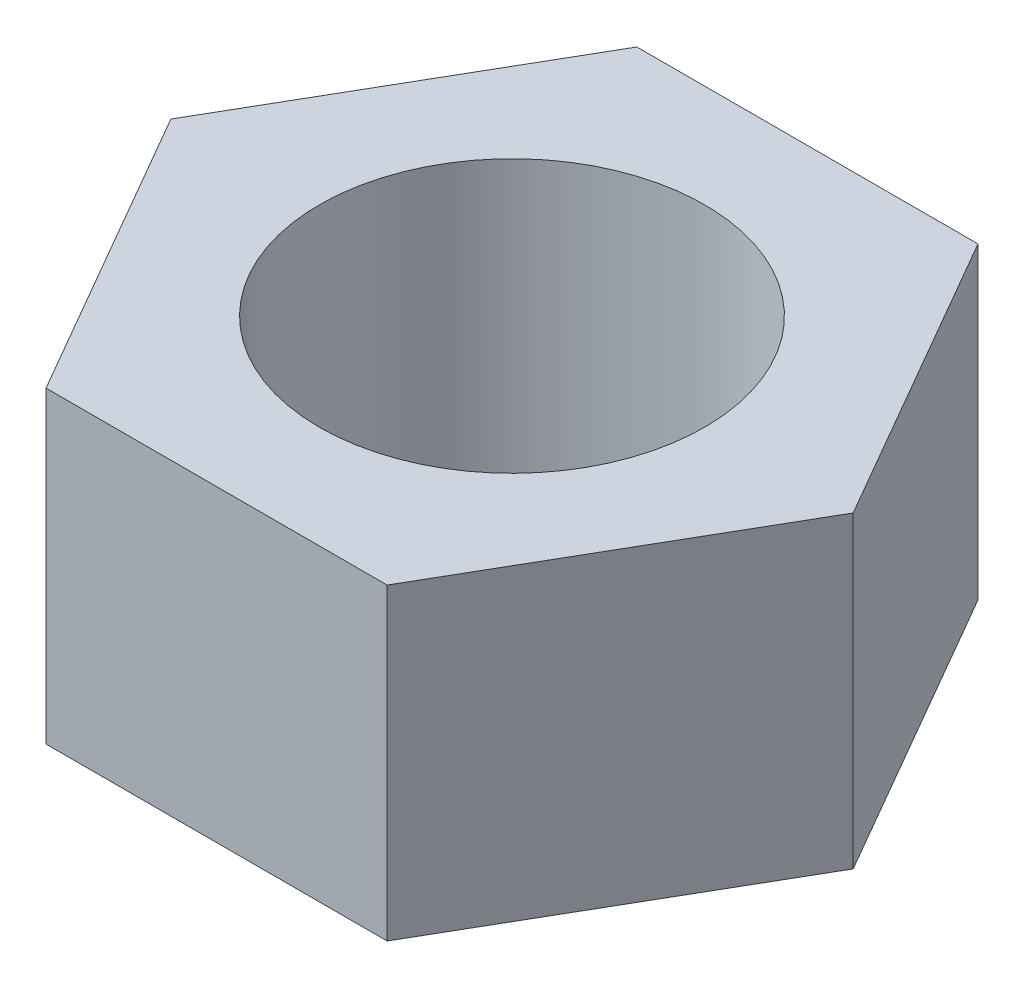
ISO-10303-21;
HEADER;
FILE_DESCRIPTION(('STEP AP214'),'2;1');
FILE_NAME('part.step','',(''),(''),'','','');
FILE_SCHEMA(('AUTOMOTIVE_DESIGN { 1 0 10303 214 1 1 1 1 }'));
ENDSEC;
DATA;
#1=APPLICATION_CONTEXT('core data for automotive mechanical design processes');
#2=APPLICATION_PROTOCOL_DEFINITION('international standard','automotive_design',2000,#1);
#3=PRODUCT_CONTEXT('',#1,'mechanical');
#4=PRODUCT('Part','Part','',(#3));
#5=PRODUCT_RELATED_PRODUCT_CATEGORY('part','',(#4));
#6=PRODUCT_DEFINITION_FORMATION('','',#4);
#7=PRODUCT_DEFINITION_CONTEXT('part definition',#1,'design');
#8=PRODUCT_DEFINITION('design','',#6,#7);
#9=PRODUCT_DEFINITION_SHAPE('','',#8);
#10=(LENGTH_UNIT() NAMED_UNIT(*) SI_UNIT(.MILLI.,.METRE.));
#11=(NAMED_UNIT(*) PLANE_ANGLE_UNIT() SI_UNIT($,.RADIAN.));
#12=(NAMED_UNIT(*) SI_UNIT($,.STERADIAN.) SOLID_ANGLE_UNIT());
#13=UNCERTAINTY_MEASURE_WITH_UNIT(LENGTH_MEASURE(1.E-05),#10,'distance_accuracy_value','');
#14=(GEOMETRIC_REPRESENTATION_CONTEXT(3) GLOBAL_UNCERTAINTY_ASSIGNED_CONTEXT((#13)) GLOBAL_UNIT_ASSIGNED_CONTEXT((#10,
#11,#12)) REPRESENTATION_CONTEXT('',''));
#15=CARTESIAN_POINT('',(0.,0.,0.));
#16=DIRECTION('',(0.,0.,1.));
#17=DIRECTION('',(1.,0.,0.));
#18=AXIS2_PLACEMENT_3D('',#15,#16,#17);
#19=CARTESIAN_POINT('',(13.2790561913614,24.,23.));
#20=DIRECTION('',(-0.866025403784439,0.,-0.5));
#21=DIRECTION('',(-0.5,0.,0.866025403784439));
#22=AXIS2_PLACEMENT_3D('',#19,#20,#21);
#23=PLANE('',#22);
#24=DIRECTION('',(0.5,0.,-0.866025403784439));
#25=VECTOR('',#24,1.);
#26=CARTESIAN_POINT('',(13.2790561913614,0.,23.));
#27=LINE('',#26,#25);
#28=CARTESIAN_POINT('',(13.2790561913614,0.,23.));
#29=VERTEX_POINT('',#28);
#30=CARTESIAN_POINT('',(26.5581123827228,0.,0.));
#31=VERTEX_POINT('',#30);
#32=EDGE_CURVE('E115',#29,#31,#27,.T.);
#33=ORIENTED_EDGE('',*,*,#32,.T.);
#34=DIRECTION('',(0.,-1.,0.));
#35=VECTOR('',#34,1.);
#36=CARTESIAN_POINT('',(26.5581123827228,24.,0.));
#37=LINE('',#36,#35);
#38=CARTESIAN_POINT('',(26.5581123827228,24.,0.));
#39=VERTEX_POINT('',#38);
#40=EDGE_CURVE('E11',#39,#31,#37,.T.);
#41=ORIENTED_EDGE('',*,*,#40,.F.);
#42=DIRECTION('',(0.5,0.,-0.866025403784439));
#43=VECTOR('',#42,1.);
#44=CARTESIAN_POINT('',(13.2790561913614,24.,23.));
#45=LINE('',#44,#43);
#46=CARTESIAN_POINT('',(13.2790561913614,24.,23.));
#47=VERTEX_POINT('',#46);
#48=EDGE_CURVE('E126',#47,#39,#45,.T.);
#49=ORIENTED_EDGE('',*,*,#48,.F.);
#50=DIRECTION('',(0.,-1.,0.));
#51=VECTOR('',#50,1.);
#52=CARTESIAN_POINT('',(13.2790561913614,24.,23.));
#53=LINE('',#52,#51);
#54=EDGE_CURVE('E111',#47,#29,#53,.T.);
#55=ORIENTED_EDGE('',*,*,#54,.T.);
#56=EDGE_LOOP('',(#33,#41,#49,#55));
#57=FACE_BOUND('',#56,.T.);
#58=ADVANCED_FACE('F31',(#57),#23,.F.);
#59=CARTESIAN_POINT('',(26.5581123827228,24.,0.));
#60=DIRECTION('',(-0.866025403784439,0.,0.5));
#61=DIRECTION('',(0.5,0.,0.866025403784439));
#62=AXIS2_PLACEMENT_3D('',#59,#60,#61);
#63=PLANE('',#62);
#64=DIRECTION('',(-0.5,0.,-0.866025403784438));
#65=VECTOR('',#64,1.);
#66=CARTESIAN_POINT('',(26.5581123827228,0.,0.));
#67=LINE('',#66,#65);
#68=CARTESIAN_POINT('',(13.2790561913614,0.,-23.));
#69=VERTEX_POINT('',#68);
#70=EDGE_CURVE('E118',#31,#69,#67,.T.);
#71=ORIENTED_EDGE('',*,*,#70,.T.);
#72=DIRECTION('',(0.,-1.,0.));
#73=VECTOR('',#72,1.);
#74=CARTESIAN_POINT('',(13.2790561913614,24.,-23.));
#75=LINE('',#74,#73);
#76=CARTESIAN_POINT('',(13.2790561913614,24.,-23.));
#77=VERTEX_POINT('',#76);
#78=EDGE_CURVE('E39',#77,#69,#75,.T.);
#79=ORIENTED_EDGE('',*,*,#78,.F.);
#80=DIRECTION('',(-0.5,0.,-0.866025403784438));
#81=VECTOR('',#80,1.);
#82=CARTESIAN_POINT('',(26.5581123827228,24.,0.));
#83=LINE('',#82,#81);
#84=EDGE_CURVE('E84',#39,#77,#83,.T.);
#85=ORIENTED_EDGE('',*,*,#84,.F.);
#86=ORIENTED_EDGE('',*,*,#40,.T.);
#87=EDGE_LOOP('',(#71,#79,#85,#86));
#88=FACE_BOUND('',#87,.T.);
#89=ADVANCED_FACE('F151',(#88),#63,.F.);
#90=CARTESIAN_POINT('',(13.2790561913614,24.,-23.));
#91=DIRECTION('',(0.,0.,1.));
#92=DIRECTION('',(1.,0.,0.));
#93=AXIS2_PLACEMENT_3D('',#90,#91,#92);
#94=PLANE('',#93);
#95=DIRECTION('',(-1.,0.,0.));
#96=VECTOR('',#95,1.);
#97=CARTESIAN_POINT('',(13.2790561913614,0.,-23.));
#98=LINE('',#97,#96);
#99=CARTESIAN_POINT('',(-13.2790561913614,0.,-23.));
#100=VERTEX_POINT('',#99);
#101=EDGE_CURVE('E121',#69,#100,#98,.T.);
#102=ORIENTED_EDGE('',*,*,#101,.T.);
#103=DIRECTION('',(0.,-1.,0.));
#104=VECTOR('',#103,1.);
#105=CARTESIAN_POINT('',(-13.2790561913614,24.,-23.));
#106=LINE('',#105,#104);
#107=CARTESIAN_POINT('',(-13.2790561913614,24.,-23.));
#108=VERTEX_POINT('',#107);
#109=EDGE_CURVE('E106',#108,#100,#106,.T.);
#110=ORIENTED_EDGE('',*,*,#109,.F.);
#111=DIRECTION('',(-1.,0.,0.));
#112=VECTOR('',#111,1.);
#113=CARTESIAN_POINT('',(13.2790561913614,24.,-23.));
#114=LINE('',#113,#112);
#115=EDGE_CURVE('E97',#77,#108,#114,.T.);
#116=ORIENTED_EDGE('',*,*,#115,.F.);
#117=ORIENTED_EDGE('',*,*,#78,.T.);
#118=EDGE_LOOP('',(#102,#110,#116,#117));
#119=FACE_BOUND('',#118,.T.);
#120=ADVANCED_FACE('F132',(#119),#94,.F.);
#121=CARTESIAN_POINT('',(-13.2790561913614,24.,-23.));
#122=DIRECTION('',(0.866025403784439,0.,0.5));
#123=DIRECTION('',(0.5,0.,-0.866025403784439));
#124=AXIS2_PLACEMENT_3D('',#121,#122,#123);
#125=PLANE('',#124);
#126=DIRECTION('',(-0.5,0.,0.866025403784439));
#127=VECTOR('',#126,1.);
#128=CARTESIAN_POINT('',(-13.2790561913614,0.,-23.));
#129=LINE('',#128,#127);
#130=CARTESIAN_POINT('',(-26.5581123827228,0.,0.));
#131=VERTEX_POINT('',#130);
#132=EDGE_CURVE('E105',#100,#131,#129,.T.);
#133=ORIENTED_EDGE('',*,*,#132,.T.);
#134=DIRECTION('',(0.,-1.,0.));
#135=VECTOR('',#134,1.);
#136=CARTESIAN_POINT('',(-26.5581123827228,24.,0.));
#137=LINE('',#136,#135);
#138=CARTESIAN_POINT('',(-26.5581123827228,24.,0.));
#139=VERTEX_POINT('',#138);
#140=EDGE_CURVE('E102',#139,#131,#137,.T.);
#141=ORIENTED_EDGE('',*,*,#140,.F.);
#142=DIRECTION('',(-0.5,0.,0.866025403784439));
#143=VECTOR('',#142,1.);
#144=CARTESIAN_POINT('',(-13.2790561913614,24.,-23.));
#145=LINE('',#144,#143);
#146=EDGE_CURVE('E91',#108,#139,#145,.T.);
#147=ORIENTED_EDGE('',*,*,#146,.F.);
#148=ORIENTED_EDGE('',*,*,#109,.T.);
#149=EDGE_LOOP('',(#133,#141,#147,#148));
#150=FACE_BOUND('',#149,.T.);
#151=ADVANCED_FACE('F103',(#150),#125,.F.);
#152=CARTESIAN_POINT('',(-26.5581123827228,24.,0.));
#153=DIRECTION('',(0.866025403784439,0.,-0.5));
#154=DIRECTION('',(-0.5,0.,-0.866025403784439));
#155=AXIS2_PLACEMENT_3D('',#152,#153,#154);
#156=PLANE('',#155);
#157=DIRECTION('',(0.5,0.,0.866025403784438));
#158=VECTOR('',#157,1.);
#159=CARTESIAN_POINT('',(-26.5581123827228,0.,0.));
#160=LINE('',#159,#158);
#161=CARTESIAN_POINT('',(-13.2790561913614,0.,23.));
#162=VERTEX_POINT('',#161);
#163=EDGE_CURVE('E70',#131,#162,#160,.T.);
#164=ORIENTED_EDGE('',*,*,#163,.T.);
#165=DIRECTION('',(0.,-1.,0.));
#166=VECTOR('',#165,1.);
#167=CARTESIAN_POINT('',(-13.2790561913614,24.,23.));
#168=LINE('',#167,#166);
#169=CARTESIAN_POINT('',(-13.2790561913614,24.,23.));
#170=VERTEX_POINT('',#169);
#171=EDGE_CURVE('E107',#170,#162,#168,.T.);
#172=ORIENTED_EDGE('',*,*,#171,.F.);
#173=DIRECTION('',(0.5,0.,0.866025403784438));
#174=VECTOR('',#173,1.);
#175=CARTESIAN_POINT('',(-26.5581123827228,24.,0.));
#176=LINE('',#175,#174);
#177=EDGE_CURVE('E95',#139,#170,#176,.T.);
#178=ORIENTED_EDGE('',*,*,#177,.F.);
#179=ORIENTED_EDGE('',*,*,#140,.T.);
#180=EDGE_LOOP('',(#164,#172,#178,#179));
#181=FACE_BOUND('',#180,.T.);
#182=ADVANCED_FACE('F109',(#181),#156,.F.);
#183=CARTESIAN_POINT('',(-13.2790561913614,24.,23.));
#184=DIRECTION('',(0.,0.,-1.));
#185=DIRECTION('',(-1.,0.,0.));
#186=AXIS2_PLACEMENT_3D('',#183,#184,#185);
#187=PLANE('',#186);
#188=DIRECTION('',(1.,0.,0.));
#189=VECTOR('',#188,1.);
#190=CARTESIAN_POINT('',(-13.2790561913614,0.,23.));
#191=LINE('',#190,#189);
#192=EDGE_CURVE('E76',#162,#29,#191,.T.);
#193=ORIENTED_EDGE('',*,*,#192,.T.);
#194=ORIENTED_EDGE('',*,*,#54,.F.);
#195=DIRECTION('',(1.,0.,0.));
#196=VECTOR('',#195,1.);
#197=CARTESIAN_POINT('',(-13.2790561913614,24.,23.));
#198=LINE('',#197,#196);
#199=EDGE_CURVE('E47',#170,#47,#198,.T.);
#200=ORIENTED_EDGE('',*,*,#199,.F.);
#201=ORIENTED_EDGE('',*,*,#171,.T.);
#202=EDGE_LOOP('',(#193,#194,#200,#201));
#203=FACE_BOUND('',#202,.T.);
#204=ADVANCED_FACE('F139',(#203),#187,.F.);
#205=CARTESIAN_POINT('',(26.5581123827228,24.,0.));
#206=DIRECTION('',(0.,1.,0.));
#207=DIRECTION('',(0.,0.,1.));
#208=AXIS2_PLACEMENT_3D('',#205,#206,#207);
#209=PLANE('',#208);
#210=CARTESIAN_POINT('',(0.,24.,0.));
#211=DIRECTION('',(0.,1.,0.));
#212=DIRECTION('',(0.,0.,1.));
#213=AXIS2_PLACEMENT_3D('',#210,#211,#212);
#214=CIRCLE('',#213,15.);
#215=CARTESIAN_POINT('',(0.,24.,15.));
#216=VERTEX_POINT('',#215);
#217=EDGE_CURVE('E206',#216,#216,#214,.T.);
#218=ORIENTED_EDGE('',*,*,#217,.F.);
#219=EDGE_LOOP('',(#218));
#220=FACE_BOUND('',#219,.T.);
#221=ORIENTED_EDGE('',*,*,#48,.T.);
#222=ORIENTED_EDGE('',*,*,#84,.T.);
#223=ORIENTED_EDGE('',*,*,#115,.T.);
#224=ORIENTED_EDGE('',*,*,#146,.T.);
#225=ORIENTED_EDGE('',*,*,#177,.T.);
#226=ORIENTED_EDGE('',*,*,#199,.T.);
#227=EDGE_LOOP('',(#221,#222,#223,#224,#225,#226));
#228=FACE_BOUND('',#227,.T.);
#229=ADVANCED_FACE('F93',(#220,#228),#209,.T.);
#230=CARTESIAN_POINT('',(26.5581123827228,0.,0.));
#231=DIRECTION('',(0.,1.,0.));
#232=DIRECTION('',(0.,0.,1.));
#233=AXIS2_PLACEMENT_3D('',#230,#231,#232);
#234=PLANE('',#233);
#235=CARTESIAN_POINT('',(0.,0.,0.));
#236=DIRECTION('',(0.,1.,0.));
#237=DIRECTION('',(0.,0.,1.));
#238=AXIS2_PLACEMENT_3D('',#235,#236,#237);
#239=CIRCLE('',#238,15.);
#240=CARTESIAN_POINT('',(0.,0.,15.));
#241=VERTEX_POINT('',#240);
#242=EDGE_CURVE('E119',#241,#241,#239,.T.);
#243=ORIENTED_EDGE('',*,*,#242,.T.);
#244=EDGE_LOOP('',(#243));
#245=FACE_BOUND('',#244,.T.);
#246=ORIENTED_EDGE('',*,*,#32,.F.);
#247=ORIENTED_EDGE('',*,*,#192,.F.);
#248=ORIENTED_EDGE('',*,*,#163,.F.);
#249=ORIENTED_EDGE('',*,*,#132,.F.);
#250=ORIENTED_EDGE('',*,*,#101,.F.);
#251=ORIENTED_EDGE('',*,*,#70,.F.);
#252=EDGE_LOOP('',(#246,#247,#248,#249,#250,#251));
#253=FACE_BOUND('',#252,.T.);
#254=ADVANCED_FACE('F135',(#245,#253),#234,.F.);
#255=CARTESIAN_POINT('',(0.,0.,0.));
#256=DIRECTION('',(0.,1.,0.));
#257=DIRECTION('',(0.,0.,1.));
#258=AXIS2_PLACEMENT_3D('',#255,#256,#257);
#259=CYLINDRICAL_SURFACE('',#258,15.);
#260=ORIENTED_EDGE('',*,*,#242,.F.);
#261=EDGE_LOOP('',(#260));
#262=FACE_BOUND('',#261,.T.);
#263=ORIENTED_EDGE('',*,*,#217,.T.);
#264=EDGE_LOOP('',(#263));
#265=FACE_BOUND('',#264,.T.);
#266=ADVANCED_FACE('F188',(#262,#265),#259,.F.);
#267=CLOSED_SHELL('',(#58,#89,#120,#151,#182,#204,#229,#254,#266));
#268=MANIFOLD_SOLID_BREP('B2',#267);
#269=ADVANCED_BREP_SHAPE_REPRESENTATION('',(#18,#268),#14);
#270=SHAPE_DEFINITION_REPRESENTATION(#9,#269);
ENDSEC;
END-ISO-10303-21;
